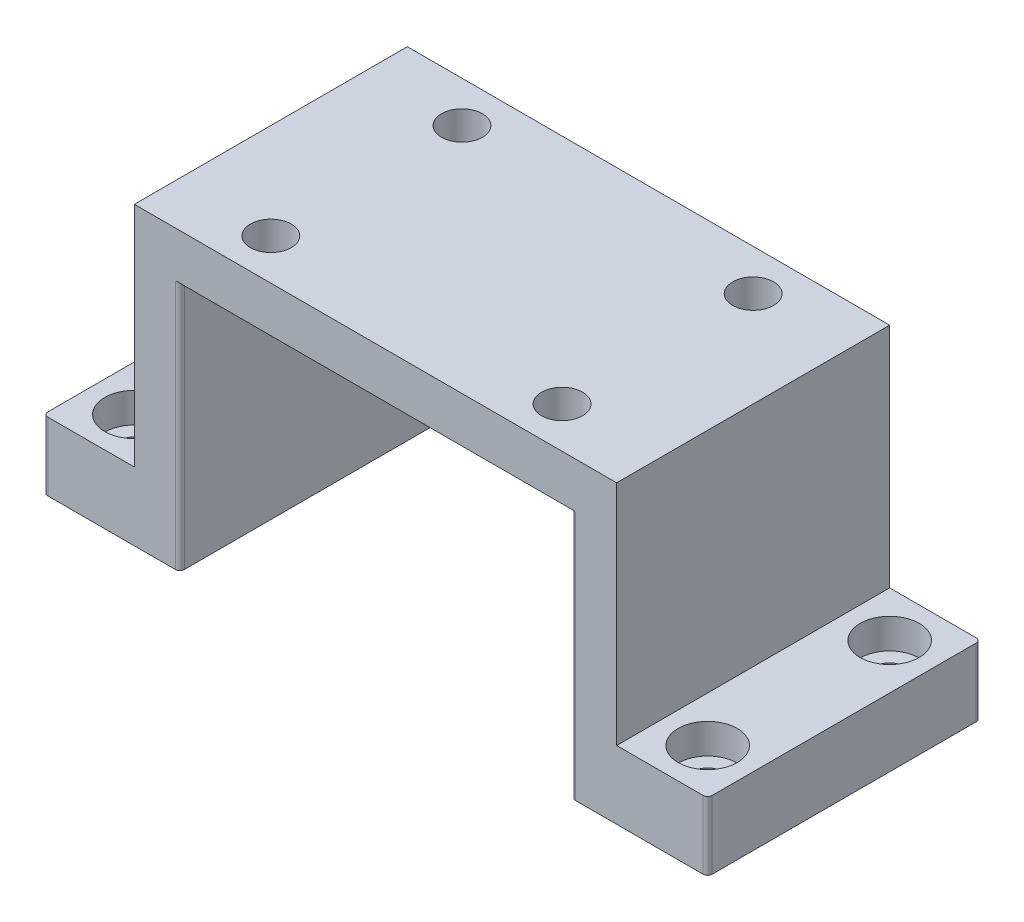
ISO-10303-21;
HEADER;
FILE_DESCRIPTION(('STEP AP214'),'2;1');
FILE_NAME('part.step','',(''),(''),'','','');
FILE_SCHEMA(('AUTOMOTIVE_DESIGN { 1 0 10303 214 1 1 1 1 }'));
ENDSEC;
DATA;
#1=APPLICATION_CONTEXT('core data for automotive mechanical design processes');
#2=APPLICATION_PROTOCOL_DEFINITION('international standard','automotive_design',2000,#1);
#3=PRODUCT_CONTEXT('',#1,'mechanical');
#4=PRODUCT('Part','Part','',(#3));
#5=PRODUCT_RELATED_PRODUCT_CATEGORY('part','',(#4));
#6=PRODUCT_DEFINITION_FORMATION('','',#4);
#7=PRODUCT_DEFINITION_CONTEXT('part definition',#1,'design');
#8=PRODUCT_DEFINITION('design','',#6,#7);
#9=PRODUCT_DEFINITION_SHAPE('','',#8);
#10=(LENGTH_UNIT() NAMED_UNIT(*) SI_UNIT(.MILLI.,.METRE.));
#11=(NAMED_UNIT(*) PLANE_ANGLE_UNIT() SI_UNIT($,.RADIAN.));
#12=(NAMED_UNIT(*) SI_UNIT($,.STERADIAN.) SOLID_ANGLE_UNIT());
#13=UNCERTAINTY_MEASURE_WITH_UNIT(LENGTH_MEASURE(1.E-05),#10,'distance_accuracy_value','');
#14=(GEOMETRIC_REPRESENTATION_CONTEXT(3) GLOBAL_UNCERTAINTY_ASSIGNED_CONTEXT((#13)) GLOBAL_UNIT_ASSIGNED_CONTEXT((#10,
#11,#12)) REPRESENTATION_CONTEXT('',''));
#15=CARTESIAN_POINT('',(0.,0.,0.));
#16=DIRECTION('',(0.,0.,1.));
#17=DIRECTION('',(1.,0.,0.));
#18=AXIS2_PLACEMENT_3D('',#15,#16,#17);
#19=CARTESIAN_POINT('',(-53.,10.,30.));
#20=DIRECTION('',(1.,0.,0.));
#21=DIRECTION('',(0.,0.,-1.));
#22=AXIS2_PLACEMENT_3D('',#19,#20,#21);
#23=PLANE('',#22);
#24=DIRECTION('',(0.,0.,-1.));
#25=VECTOR('',#24,1.);
#26=CARTESIAN_POINT('',(-53.,-40.,-30.));
#27=LINE('',#26,#25);
#28=CARTESIAN_POINT('',(-53.,-40.,30.));
#29=VERTEX_POINT('',#28);
#30=CARTESIAN_POINT('',(-53.,-40.,-30.));
#31=VERTEX_POINT('',#30);
#32=EDGE_CURVE('E198',#29,#31,#27,.T.);
#33=ORIENTED_EDGE('',*,*,#32,.F.);
#34=DIRECTION('',(0.,-1.,0.));
#35=VECTOR('',#34,1.);
#36=CARTESIAN_POINT('',(-53.,10.,30.));
#37=LINE('',#36,#35);
#38=CARTESIAN_POINT('',(-53.,10.,30.));
#39=VERTEX_POINT('',#38);
#40=EDGE_CURVE('E203',#39,#29,#37,.T.);
#41=ORIENTED_EDGE('',*,*,#40,.F.);
#42=DIRECTION('',(0.,0.,1.));
#43=VECTOR('',#42,1.);
#44=CARTESIAN_POINT('',(-53.,10.,30.));
#45=LINE('',#44,#43);
#46=CARTESIAN_POINT('',(-53.,10.,-30.));
#47=VERTEX_POINT('',#46);
#48=EDGE_CURVE('E200',#47,#39,#45,.T.);
#49=ORIENTED_EDGE('',*,*,#48,.F.);
#50=DIRECTION('',(0.,-1.,0.));
#51=VECTOR('',#50,1.);
#52=CARTESIAN_POINT('',(-53.,10.,-30.));
#53=LINE('',#52,#51);
#54=EDGE_CURVE('E185',#47,#31,#53,.T.);
#55=ORIENTED_EDGE('',*,*,#54,.T.);
#56=EDGE_LOOP('',(#33,#41,#49,#55));
#57=FACE_BOUND('',#56,.T.);
#58=ADVANCED_FACE('F42',(#57),#23,.F.);
#59=CARTESIAN_POINT('',(53.,10.,30.));
#60=DIRECTION('',(-1.,0.,0.));
#61=DIRECTION('',(0.,0.,1.));
#62=AXIS2_PLACEMENT_3D('',#59,#60,#61);
#63=PLANE('',#62);
#64=DIRECTION('',(0.,0.,1.));
#65=VECTOR('',#64,1.);
#66=CARTESIAN_POINT('',(53.,-40.,30.));
#67=LINE('',#66,#65);
#68=CARTESIAN_POINT('',(53.,-40.,-30.));
#69=VERTEX_POINT('',#68);
#70=CARTESIAN_POINT('',(53.,-40.,30.));
#71=VERTEX_POINT('',#70);
#72=EDGE_CURVE('E223',#69,#71,#67,.T.);
#73=ORIENTED_EDGE('',*,*,#72,.F.);
#74=DIRECTION('',(0.,-1.,0.));
#75=VECTOR('',#74,1.);
#76=CARTESIAN_POINT('',(53.,10.,-30.));
#77=LINE('',#76,#75);
#78=CARTESIAN_POINT('',(53.,10.,-30.));
#79=VERTEX_POINT('',#78);
#80=EDGE_CURVE('E202',#79,#69,#77,.T.);
#81=ORIENTED_EDGE('',*,*,#80,.F.);
#82=DIRECTION('',(0.,0.,-1.));
#83=VECTOR('',#82,1.);
#84=CARTESIAN_POINT('',(53.,10.,30.));
#85=LINE('',#84,#83);
#86=CARTESIAN_POINT('',(53.,10.,30.));
#87=VERTEX_POINT('',#86);
#88=EDGE_CURVE('E274',#87,#79,#85,.T.);
#89=ORIENTED_EDGE('',*,*,#88,.F.);
#90=DIRECTION('',(0.,-1.,0.));
#91=VECTOR('',#90,1.);
#92=CARTESIAN_POINT('',(53.,10.,30.));
#93=LINE('',#92,#91);
#94=EDGE_CURVE('E287',#87,#71,#93,.T.);
#95=ORIENTED_EDGE('',*,*,#94,.T.);
#96=EDGE_LOOP('',(#73,#81,#89,#95));
#97=FACE_BOUND('',#96,.T.);
#98=ADVANCED_FACE('F430',(#97),#63,.F.);
#99=CARTESIAN_POINT('',(0.,0.,0.));
#100=DIRECTION('',(0.,-1.,0.));
#101=DIRECTION('',(0.,0.,-1.));
#102=AXIS2_PLACEMENT_3D('',#99,#100,#101);
#103=PLANE('',#102);
#104=CARTESIAN_POINT('',(-32.,0.,21.));
#105=DIRECTION('',(0.,-1.,0.));
#106=DIRECTION('',(0.,0.,-1.));
#107=AXIS2_PLACEMENT_3D('',#104,#105,#106);
#108=CIRCLE('',#107,4.5);
#109=CARTESIAN_POINT('',(-32.,0.,16.5));
#110=VERTEX_POINT('',#109);
#111=EDGE_CURVE('E209',#110,#110,#108,.T.);
#112=ORIENTED_EDGE('',*,*,#111,.F.);
#113=EDGE_LOOP('',(#112));
#114=FACE_BOUND('',#113,.T.);
#115=CARTESIAN_POINT('',(32.,0.,21.));
#116=DIRECTION('',(0.,-1.,0.));
#117=DIRECTION('',(0.,0.,-1.));
#118=AXIS2_PLACEMENT_3D('',#115,#116,#117);
#119=CIRCLE('',#118,4.5);
#120=CARTESIAN_POINT('',(32.,0.,16.5));
#121=VERTEX_POINT('',#120);
#122=EDGE_CURVE('E217',#121,#121,#119,.T.);
#123=ORIENTED_EDGE('',*,*,#122,.F.);
#124=EDGE_LOOP('',(#123));
#125=FACE_BOUND('',#124,.T.);
#126=CARTESIAN_POINT('',(32.,0.,-21.));
#127=DIRECTION('',(0.,-1.,0.));
#128=DIRECTION('',(0.,0.,-1.));
#129=AXIS2_PLACEMENT_3D('',#126,#127,#128);
#130=CIRCLE('',#129,4.5);
#131=CARTESIAN_POINT('',(32.,0.,-25.5));
#132=VERTEX_POINT('',#131);
#133=EDGE_CURVE('E669',#132,#132,#130,.T.);
#134=ORIENTED_EDGE('',*,*,#133,.F.);
#135=EDGE_LOOP('',(#134));
#136=FACE_BOUND('',#135,.T.);
#137=CARTESIAN_POINT('',(-32.,0.,-21.));
#138=DIRECTION('',(0.,-1.,0.));
#139=DIRECTION('',(0.,0.,-1.));
#140=AXIS2_PLACEMENT_3D('',#137,#138,#139);
#141=CIRCLE('',#140,4.5);
#142=CARTESIAN_POINT('',(-32.,0.,-25.5));
#143=VERTEX_POINT('',#142);
#144=EDGE_CURVE('E665',#143,#143,#141,.T.);
#145=ORIENTED_EDGE('',*,*,#144,.F.);
#146=EDGE_LOOP('',(#145));
#147=FACE_BOUND('',#146,.T.);
#148=DIRECTION('',(-1.,0.,0.));
#149=VECTOR('',#148,1.);
#150=CARTESIAN_POINT('',(-53.,0.,-30.));
#151=LINE('',#150,#149);
#152=CARTESIAN_POINT('',(44.,0.,-30.));
#153=VERTEX_POINT('',#152);
#154=CARTESIAN_POINT('',(-44.,0.,-30.));
#155=VERTEX_POINT('',#154);
#156=EDGE_CURVE('E270',#153,#155,#151,.T.);
#157=ORIENTED_EDGE('',*,*,#156,.F.);
#158=CARTESIAN_POINT('',(44.,0.,-29.));
#159=DIRECTION('',(0.,-1.,0.));
#160=DIRECTION('',(0.,0.,-1.));
#161=AXIS2_PLACEMENT_3D('',#158,#159,#160);
#162=CIRCLE('',#161,1.);
#163=CARTESIAN_POINT('',(43.,0.,-29.));
#164=VERTEX_POINT('',#163);
#165=EDGE_CURVE('E388',#153,#164,#162,.F.);
#166=ORIENTED_EDGE('',*,*,#165,.T.);
#167=DIRECTION('',(0.,0.,-1.));
#168=VECTOR('',#167,1.);
#169=CARTESIAN_POINT('',(43.,0.,30.));
#170=LINE('',#169,#168);
#171=CARTESIAN_POINT('',(43.,0.,29.));
#172=VERTEX_POINT('',#171);
#173=EDGE_CURVE('E241',#172,#164,#170,.T.);
#174=ORIENTED_EDGE('',*,*,#173,.F.);
#175=CARTESIAN_POINT('',(44.,0.,29.));
#176=DIRECTION('',(0.,-1.,0.));
#177=DIRECTION('',(0.,0.,-1.));
#178=AXIS2_PLACEMENT_3D('',#175,#176,#177);
#179=CIRCLE('',#178,1.);
#180=CARTESIAN_POINT('',(44.,0.,30.));
#181=VERTEX_POINT('',#180);
#182=EDGE_CURVE('E51',#172,#181,#179,.F.);
#183=ORIENTED_EDGE('',*,*,#182,.T.);
#184=DIRECTION('',(1.,0.,0.));
#185=VECTOR('',#184,1.);
#186=CARTESIAN_POINT('',(-53.,0.,30.));
#187=LINE('',#186,#185);
#188=CARTESIAN_POINT('',(-44.,0.,30.));
#189=VERTEX_POINT('',#188);
#190=EDGE_CURVE('E279',#189,#181,#187,.T.);
#191=ORIENTED_EDGE('',*,*,#190,.F.);
#192=CARTESIAN_POINT('',(-44.,0.,29.));
#193=DIRECTION('',(0.,-1.,0.));
#194=DIRECTION('',(0.,0.,-1.));
#195=AXIS2_PLACEMENT_3D('',#192,#193,#194);
#196=CIRCLE('',#195,1.);
#197=CARTESIAN_POINT('',(-43.,0.,29.));
#198=VERTEX_POINT('',#197);
#199=EDGE_CURVE('E11',#189,#198,#196,.F.);
#200=ORIENTED_EDGE('',*,*,#199,.T.);
#201=DIRECTION('',(0.,0.,1.));
#202=VECTOR('',#201,1.);
#203=CARTESIAN_POINT('',(-43.,0.,30.));
#204=LINE('',#203,#202);
#205=CARTESIAN_POINT('',(-43.,0.,-29.));
#206=VERTEX_POINT('',#205);
#207=EDGE_CURVE('E254',#206,#198,#204,.T.);
#208=ORIENTED_EDGE('',*,*,#207,.F.);
#209=CARTESIAN_POINT('',(-44.,0.,-29.));
#210=DIRECTION('',(0.,-1.,0.));
#211=DIRECTION('',(0.,0.,-1.));
#212=AXIS2_PLACEMENT_3D('',#209,#210,#211);
#213=CIRCLE('',#212,1.);
#214=EDGE_CURVE('E391',#206,#155,#213,.F.);
#215=ORIENTED_EDGE('',*,*,#214,.T.);
#216=EDGE_LOOP('',(#157,#166,#174,#183,#191,#200,#208,#215));
#217=FACE_BOUND('',#216,.T.);
#218=ADVANCED_FACE('F400',(#114,#125,#136,#147,#217),#103,.T.);
#219=CARTESIAN_POINT('',(-53.,10.,-30.));
#220=DIRECTION('',(0.,0.,1.));
#221=DIRECTION('',(1.,0.,0.));
#222=AXIS2_PLACEMENT_3D('',#219,#220,#221);
#223=PLANE('',#222);
#224=DIRECTION('',(-1.,0.,0.));
#225=VECTOR('',#224,1.);
#226=CARTESIAN_POINT('',(73.,-40.,-30.));
#227=LINE('',#226,#225);
#228=CARTESIAN_POINT('',(72.,-40.,-30.));
#229=VERTEX_POINT('',#228);
#230=EDGE_CURVE('E238',#229,#69,#227,.T.);
#231=ORIENTED_EDGE('',*,*,#230,.F.);
#232=DIRECTION('',(0.,1.,0.));
#233=VECTOR('',#232,1.);
#234=CARTESIAN_POINT('',(72.,10.,-30.));
#235=LINE('',#234,#233);
#236=CARTESIAN_POINT('',(72.,-55.,-30.));
#237=VERTEX_POINT('',#236);
#238=EDGE_CURVE('E323',#229,#237,#235,.F.);
#239=ORIENTED_EDGE('',*,*,#238,.T.);
#240=DIRECTION('',(1.,0.,0.));
#241=VECTOR('',#240,1.);
#242=CARTESIAN_POINT('',(53.,-55.,-30.));
#243=LINE('',#242,#241);
#244=CARTESIAN_POINT('',(44.,-55.,-30.));
#245=VERTEX_POINT('',#244);
#246=EDGE_CURVE('E250',#245,#237,#243,.T.);
#247=ORIENTED_EDGE('',*,*,#246,.F.);
#248=DIRECTION('',(0.,1.,0.));
#249=VECTOR('',#248,1.);
#250=CARTESIAN_POINT('',(44.,10.,-30.));
#251=LINE('',#250,#249);
#252=EDGE_CURVE('E319',#245,#153,#251,.T.);
#253=ORIENTED_EDGE('',*,*,#252,.T.);
#254=ORIENTED_EDGE('',*,*,#156,.T.);
#255=DIRECTION('',(0.,1.,0.));
#256=VECTOR('',#255,1.);
#257=CARTESIAN_POINT('',(-44.,10.,-30.));
#258=LINE('',#257,#256);
#259=CARTESIAN_POINT('',(-44.,-55.,-30.));
#260=VERTEX_POINT('',#259);
#261=EDGE_CURVE('E316',#155,#260,#258,.F.);
#262=ORIENTED_EDGE('',*,*,#261,.T.);
#263=DIRECTION('',(1.,0.,0.));
#264=VECTOR('',#263,1.);
#265=CARTESIAN_POINT('',(-53.,-55.,-30.));
#266=LINE('',#265,#264);
#267=CARTESIAN_POINT('',(-72.,-55.,-30.));
#268=VERTEX_POINT('',#267);
#269=EDGE_CURVE('E258',#268,#260,#266,.T.);
#270=ORIENTED_EDGE('',*,*,#269,.F.);
#271=DIRECTION('',(0.,-1.,0.));
#272=VECTOR('',#271,1.);
#273=CARTESIAN_POINT('',(-72.,10.,-30.));
#274=LINE('',#273,#272);
#275=CARTESIAN_POINT('',(-72.,-40.,-30.));
#276=VERTEX_POINT('',#275);
#277=EDGE_CURVE('E189',#268,#276,#274,.F.);
#278=ORIENTED_EDGE('',*,*,#277,.T.);
#279=DIRECTION('',(1.,0.,0.));
#280=VECTOR('',#279,1.);
#281=CARTESIAN_POINT('',(-73.,-40.,-30.));
#282=LINE('',#281,#280);
#283=EDGE_CURVE('E181',#276,#31,#282,.T.);
#284=ORIENTED_EDGE('',*,*,#283,.T.);
#285=ORIENTED_EDGE('',*,*,#54,.F.);
#286=DIRECTION('',(-1.,0.,0.));
#287=VECTOR('',#286,1.);
#288=CARTESIAN_POINT('',(-53.,10.,-30.));
#289=LINE('',#288,#287);
#290=EDGE_CURVE('E278',#79,#47,#289,.T.);
#291=ORIENTED_EDGE('',*,*,#290,.F.);
#292=ORIENTED_EDGE('',*,*,#80,.T.);
#293=EDGE_LOOP('',(#231,#239,#247,#253,#254,#262,#270,#278,#284,#285,#291,#292));
#294=FACE_BOUND('',#293,.T.);
#295=ADVANCED_FACE('F184',(#294),#223,.F.);
#296=CARTESIAN_POINT('',(-53.,10.,30.));
#297=DIRECTION('',(0.,0.,-1.));
#298=DIRECTION('',(-1.,0.,0.));
#299=AXIS2_PLACEMENT_3D('',#296,#297,#298);
#300=PLANE('',#299);
#301=DIRECTION('',(-1.,0.,0.));
#302=VECTOR('',#301,1.);
#303=CARTESIAN_POINT('',(53.,-55.,30.));
#304=LINE('',#303,#302);
#305=CARTESIAN_POINT('',(72.,-55.,30.));
#306=VERTEX_POINT('',#305);
#307=CARTESIAN_POINT('',(44.,-55.,30.));
#308=VERTEX_POINT('',#307);
#309=EDGE_CURVE('E242',#306,#308,#304,.T.);
#310=ORIENTED_EDGE('',*,*,#309,.F.);
#311=DIRECTION('',(0.,-1.,0.));
#312=VECTOR('',#311,1.);
#313=CARTESIAN_POINT('',(72.,10.,30.));
#314=LINE('',#313,#312);
#315=CARTESIAN_POINT('',(72.,-40.,30.));
#316=VERTEX_POINT('',#315);
#317=EDGE_CURVE('E374',#306,#316,#314,.F.);
#318=ORIENTED_EDGE('',*,*,#317,.T.);
#319=DIRECTION('',(-1.,0.,0.));
#320=VECTOR('',#319,1.);
#321=CARTESIAN_POINT('',(73.,-40.,30.));
#322=LINE('',#321,#320);
#323=EDGE_CURVE('E232',#316,#71,#322,.T.);
#324=ORIENTED_EDGE('',*,*,#323,.T.);
#325=ORIENTED_EDGE('',*,*,#94,.F.);
#326=DIRECTION('',(1.,0.,0.));
#327=VECTOR('',#326,1.);
#328=CARTESIAN_POINT('',(-53.,10.,30.));
#329=LINE('',#328,#327);
#330=EDGE_CURVE('E284',#39,#87,#329,.T.);
#331=ORIENTED_EDGE('',*,*,#330,.F.);
#332=ORIENTED_EDGE('',*,*,#40,.T.);
#333=DIRECTION('',(1.,0.,0.));
#334=VECTOR('',#333,1.);
#335=CARTESIAN_POINT('',(-73.,-40.,30.));
#336=LINE('',#335,#334);
#337=CARTESIAN_POINT('',(-72.,-40.,30.));
#338=VERTEX_POINT('',#337);
#339=EDGE_CURVE('E192',#338,#29,#336,.T.);
#340=ORIENTED_EDGE('',*,*,#339,.F.);
#341=DIRECTION('',(0.,1.,0.));
#342=VECTOR('',#341,1.);
#343=CARTESIAN_POINT('',(-72.,10.,30.));
#344=LINE('',#343,#342);
#345=CARTESIAN_POINT('',(-72.,-55.,30.));
#346=VERTEX_POINT('',#345);
#347=EDGE_CURVE('E364',#338,#346,#344,.F.);
#348=ORIENTED_EDGE('',*,*,#347,.T.);
#349=DIRECTION('',(-1.,0.,0.));
#350=VECTOR('',#349,1.);
#351=CARTESIAN_POINT('',(-53.,-55.,30.));
#352=LINE('',#351,#350);
#353=CARTESIAN_POINT('',(-44.,-55.,30.));
#354=VERTEX_POINT('',#353);
#355=EDGE_CURVE('E266',#354,#346,#352,.T.);
#356=ORIENTED_EDGE('',*,*,#355,.F.);
#357=DIRECTION('',(0.,1.,0.));
#358=VECTOR('',#357,1.);
#359=CARTESIAN_POINT('',(-44.,10.,30.));
#360=LINE('',#359,#358);
#361=EDGE_CURVE('E367',#354,#189,#360,.T.);
#362=ORIENTED_EDGE('',*,*,#361,.T.);
#363=ORIENTED_EDGE('',*,*,#190,.T.);
#364=DIRECTION('',(0.,1.,0.));
#365=VECTOR('',#364,1.);
#366=CARTESIAN_POINT('',(44.,10.,30.));
#367=LINE('',#366,#365);
#368=EDGE_CURVE('E371',#181,#308,#367,.F.);
#369=ORIENTED_EDGE('',*,*,#368,.T.);
#370=EDGE_LOOP('',(#310,#318,#324,#325,#331,#332,#340,#348,#356,#362,#363,#369));
#371=FACE_BOUND('',#370,.T.);
#372=ADVANCED_FACE('F408',(#371),#300,.F.);
#373=CARTESIAN_POINT('',(0.,10.,0.));
#374=DIRECTION('',(0.,-1.,0.));
#375=DIRECTION('',(0.,0.,-1.));
#376=AXIS2_PLACEMENT_3D('',#373,#374,#375);
#377=PLANE('',#376);
#378=CARTESIAN_POINT('',(-32.,10.,21.));
#379=DIRECTION('',(0.,1.,0.));
#380=DIRECTION('',(0.,0.,-1.));
#381=AXIS2_PLACEMENT_3D('',#378,#379,#380);
#382=CIRCLE('',#381,4.5);
#383=CARTESIAN_POINT('',(-32.,10.,16.5));
#384=VERTEX_POINT('',#383);
#385=EDGE_CURVE('E646',#384,#384,#382,.T.);
#386=ORIENTED_EDGE('',*,*,#385,.F.);
#387=EDGE_LOOP('',(#386));
#388=FACE_BOUND('',#387,.T.);
#389=CARTESIAN_POINT('',(32.,10.,21.));
#390=DIRECTION('',(0.,1.,0.));
#391=DIRECTION('',(0.,0.,1.));
#392=AXIS2_PLACEMENT_3D('',#389,#390,#391);
#393=CIRCLE('',#392,4.5);
#394=CARTESIAN_POINT('',(32.,10.,25.5));
#395=VERTEX_POINT('',#394);
#396=EDGE_CURVE('E655',#395,#395,#393,.T.);
#397=ORIENTED_EDGE('',*,*,#396,.F.);
#398=EDGE_LOOP('',(#397));
#399=FACE_BOUND('',#398,.T.);
#400=CARTESIAN_POINT('',(32.,10.,-21.));
#401=DIRECTION('',(0.,1.,0.));
#402=DIRECTION('',(0.,0.,-1.));
#403=AXIS2_PLACEMENT_3D('',#400,#401,#402);
#404=CIRCLE('',#403,4.5);
#405=CARTESIAN_POINT('',(32.,10.,-25.5));
#406=VERTEX_POINT('',#405);
#407=EDGE_CURVE('E650',#406,#406,#404,.T.);
#408=ORIENTED_EDGE('',*,*,#407,.F.);
#409=EDGE_LOOP('',(#408));
#410=FACE_BOUND('',#409,.T.);
#411=CARTESIAN_POINT('',(-32.,10.,-21.));
#412=DIRECTION('',(0.,1.,0.));
#413=DIRECTION('',(0.,0.,1.));
#414=AXIS2_PLACEMENT_3D('',#411,#412,#413);
#415=CIRCLE('',#414,4.5);
#416=CARTESIAN_POINT('',(-32.,10.,-16.5));
#417=VERTEX_POINT('',#416);
#418=EDGE_CURVE('E654',#417,#417,#415,.T.);
#419=ORIENTED_EDGE('',*,*,#418,.F.);
#420=EDGE_LOOP('',(#419));
#421=FACE_BOUND('',#420,.T.);
#422=ORIENTED_EDGE('',*,*,#88,.T.);
#423=ORIENTED_EDGE('',*,*,#290,.T.);
#424=ORIENTED_EDGE('',*,*,#48,.T.);
#425=ORIENTED_EDGE('',*,*,#330,.T.);
#426=EDGE_LOOP('',(#422,#423,#424,#425));
#427=FACE_BOUND('',#426,.T.);
#428=ADVANCED_FACE('F433',(#388,#399,#410,#421,#427),#377,.F.);
#429=CARTESIAN_POINT('',(-43.,-55.,30.));
#430=DIRECTION('',(-1.,0.,0.));
#431=DIRECTION('',(0.,0.,1.));
#432=AXIS2_PLACEMENT_3D('',#429,#430,#431);
#433=PLANE('',#432);
#434=DIRECTION('',(0.,0.,1.));
#435=VECTOR('',#434,1.);
#436=CARTESIAN_POINT('',(-43.,-55.,30.));
#437=LINE('',#436,#435);
#438=CARTESIAN_POINT('',(-43.,-55.,-29.));
#439=VERTEX_POINT('',#438);
#440=CARTESIAN_POINT('',(-43.,-55.,29.));
#441=VERTEX_POINT('',#440);
#442=EDGE_CURVE('E262',#439,#441,#437,.T.);
#443=ORIENTED_EDGE('',*,*,#442,.F.);
#444=DIRECTION('',(0.,1.,0.));
#445=VECTOR('',#444,1.);
#446=CARTESIAN_POINT('',(-43.,-55.,-29.));
#447=LINE('',#446,#445);
#448=EDGE_CURVE('E348',#439,#206,#447,.T.);
#449=ORIENTED_EDGE('',*,*,#448,.T.);
#450=ORIENTED_EDGE('',*,*,#207,.T.);
#451=DIRECTION('',(0.,1.,0.));
#452=VECTOR('',#451,1.);
#453=CARTESIAN_POINT('',(-43.,-55.,29.));
#454=LINE('',#453,#452);
#455=EDGE_CURVE('E345',#198,#441,#454,.F.);
#456=ORIENTED_EDGE('',*,*,#455,.T.);
#457=EDGE_LOOP('',(#443,#449,#450,#456));
#458=FACE_BOUND('',#457,.T.);
#459=ADVANCED_FACE('F452',(#458),#433,.F.);
#460=CARTESIAN_POINT('',(0.,-55.,0.));
#461=DIRECTION('',(0.,-1.,0.));
#462=DIRECTION('',(0.,0.,-1.));
#463=AXIS2_PLACEMENT_3D('',#460,#461,#462);
#464=PLANE('',#463);
#465=CARTESIAN_POINT('',(-63.,-55.,20.));
#466=DIRECTION('',(0.,1.,0.));
#467=DIRECTION('',(0.,0.,1.));
#468=AXIS2_PLACEMENT_3D('',#465,#466,#467);
#469=CIRCLE('',#468,3.3);
#470=CARTESIAN_POINT('',(-63.,-55.,23.3));
#471=VERTEX_POINT('',#470);
#472=EDGE_CURVE('E617',#471,#471,#469,.T.);
#473=ORIENTED_EDGE('',*,*,#472,.T.);
#474=EDGE_LOOP('',(#473));
#475=FACE_BOUND('',#474,.T.);
#476=CARTESIAN_POINT('',(-63.,-55.,-20.));
#477=DIRECTION('',(0.,1.,0.));
#478=DIRECTION('',(0.,0.,1.));
#479=AXIS2_PLACEMENT_3D('',#476,#477,#478);
#480=CIRCLE('',#479,3.3);
#481=CARTESIAN_POINT('',(-63.,-55.,-16.7));
#482=VERTEX_POINT('',#481);
#483=EDGE_CURVE('E608',#482,#482,#480,.T.);
#484=ORIENTED_EDGE('',*,*,#483,.T.);
#485=EDGE_LOOP('',(#484));
#486=FACE_BOUND('',#485,.T.);
#487=ORIENTED_EDGE('',*,*,#269,.T.);
#488=CARTESIAN_POINT('',(-44.,-55.,-29.));
#489=DIRECTION('',(0.,-1.,0.));
#490=DIRECTION('',(0.,0.,-1.));
#491=AXIS2_PLACEMENT_3D('',#488,#489,#490);
#492=CIRCLE('',#491,1.);
#493=EDGE_CURVE('E361',#260,#439,#492,.T.);
#494=ORIENTED_EDGE('',*,*,#493,.T.);
#495=ORIENTED_EDGE('',*,*,#442,.T.);
#496=CARTESIAN_POINT('',(-44.,-55.,29.));
#497=DIRECTION('',(0.,-1.,0.));
#498=DIRECTION('',(0.,0.,-1.));
#499=AXIS2_PLACEMENT_3D('',#496,#497,#498);
#500=CIRCLE('',#499,1.);
#501=EDGE_CURVE('E355',#441,#354,#500,.T.);
#502=ORIENTED_EDGE('',*,*,#501,.T.);
#503=ORIENTED_EDGE('',*,*,#355,.T.);
#504=CARTESIAN_POINT('',(-72.,-55.,29.));
#505=DIRECTION('',(0.,-1.,0.));
#506=DIRECTION('',(0.,0.,-1.));
#507=AXIS2_PLACEMENT_3D('',#504,#505,#506);
#508=CIRCLE('',#507,1.);
#509=CARTESIAN_POINT('',(-73.,-55.,29.));
#510=VERTEX_POINT('',#509);
#511=EDGE_CURVE('E352',#346,#510,#508,.T.);
#512=ORIENTED_EDGE('',*,*,#511,.T.);
#513=DIRECTION('',(0.,0.,1.));
#514=VECTOR('',#513,1.);
#515=CARTESIAN_POINT('',(-73.,-55.,-30.));
#516=LINE('',#515,#514);
#517=CARTESIAN_POINT('',(-73.,-55.,-29.));
#518=VERTEX_POINT('',#517);
#519=EDGE_CURVE('E208',#518,#510,#516,.T.);
#520=ORIENTED_EDGE('',*,*,#519,.F.);
#521=CARTESIAN_POINT('',(-72.,-55.,-29.));
#522=DIRECTION('',(0.,-1.,0.));
#523=DIRECTION('',(0.,0.,-1.));
#524=AXIS2_PLACEMENT_3D('',#521,#522,#523);
#525=CIRCLE('',#524,1.);
#526=EDGE_CURVE('E358',#518,#268,#525,.T.);
#527=ORIENTED_EDGE('',*,*,#526,.T.);
#528=EDGE_LOOP('',(#487,#494,#495,#502,#503,#512,#520,#527));
#529=FACE_BOUND('',#528,.T.);
#530=ADVANCED_FACE('F438',(#475,#486,#529),#464,.T.);
#531=CARTESIAN_POINT('',(43.,-55.,30.));
#532=DIRECTION('',(1.,0.,0.));
#533=DIRECTION('',(0.,0.,-1.));
#534=AXIS2_PLACEMENT_3D('',#531,#532,#533);
#535=PLANE('',#534);
#536=ORIENTED_EDGE('',*,*,#173,.T.);
#537=DIRECTION('',(0.,1.,0.));
#538=VECTOR('',#537,1.);
#539=CARTESIAN_POINT('',(43.,-55.,-29.));
#540=LINE('',#539,#538);
#541=CARTESIAN_POINT('',(43.,-55.,-29.));
#542=VERTEX_POINT('',#541);
#543=EDGE_CURVE('E342',#164,#542,#540,.F.);
#544=ORIENTED_EDGE('',*,*,#543,.T.);
#545=DIRECTION('',(0.,0.,-1.));
#546=VECTOR('',#545,1.);
#547=CARTESIAN_POINT('',(43.,-55.,30.));
#548=LINE('',#547,#546);
#549=CARTESIAN_POINT('',(43.,-55.,29.));
#550=VERTEX_POINT('',#549);
#551=EDGE_CURVE('E246',#550,#542,#548,.T.);
#552=ORIENTED_EDGE('',*,*,#551,.F.);
#553=DIRECTION('',(0.,1.,0.));
#554=VECTOR('',#553,1.);
#555=CARTESIAN_POINT('',(43.,-55.,29.));
#556=LINE('',#555,#554);
#557=EDGE_CURVE('E338',#550,#172,#556,.T.);
#558=ORIENTED_EDGE('',*,*,#557,.T.);
#559=EDGE_LOOP('',(#536,#544,#552,#558));
#560=FACE_BOUND('',#559,.T.);
#561=ADVANCED_FACE('F507',(#560),#535,.F.);
#562=CARTESIAN_POINT('',(0.,-55.,0.));
#563=DIRECTION('',(0.,1.,0.));
#564=DIRECTION('',(0.,0.,1.));
#565=AXIS2_PLACEMENT_3D('',#562,#563,#564);
#566=PLANE('',#565);
#567=CARTESIAN_POINT('',(63.,-55.,-20.));
#568=DIRECTION('',(0.,1.,0.));
#569=DIRECTION('',(0.,0.,1.));
#570=AXIS2_PLACEMENT_3D('',#567,#568,#569);
#571=CIRCLE('',#570,3.29999999999999);
#572=CARTESIAN_POINT('',(63.,-55.,-16.7));
#573=VERTEX_POINT('',#572);
#574=EDGE_CURVE('E593',#573,#573,#571,.T.);
#575=ORIENTED_EDGE('',*,*,#574,.T.);
#576=EDGE_LOOP('',(#575));
#577=FACE_BOUND('',#576,.T.);
#578=CARTESIAN_POINT('',(63.,-55.,20.));
#579=DIRECTION('',(0.,1.,0.));
#580=DIRECTION('',(0.,0.,1.));
#581=AXIS2_PLACEMENT_3D('',#578,#579,#580);
#582=CIRCLE('',#581,3.29999999999999);
#583=CARTESIAN_POINT('',(63.,-55.,23.3));
#584=VERTEX_POINT('',#583);
#585=EDGE_CURVE('E588',#584,#584,#582,.T.);
#586=ORIENTED_EDGE('',*,*,#585,.T.);
#587=EDGE_LOOP('',(#586));
#588=FACE_BOUND('',#587,.T.);
#589=ORIENTED_EDGE('',*,*,#246,.T.);
#590=CARTESIAN_POINT('',(72.,-55.,-29.));
#591=DIRECTION('',(0.,1.,0.));
#592=DIRECTION('',(0.,0.,1.));
#593=AXIS2_PLACEMENT_3D('',#590,#591,#592);
#594=CIRCLE('',#593,1.);
#595=CARTESIAN_POINT('',(73.,-55.,-29.));
#596=VERTEX_POINT('',#595);
#597=EDGE_CURVE('E335',#237,#596,#594,.F.);
#598=ORIENTED_EDGE('',*,*,#597,.T.);
#599=DIRECTION('',(0.,0.,-1.));
#600=VECTOR('',#599,1.);
#601=CARTESIAN_POINT('',(73.,-55.,30.));
#602=LINE('',#601,#600);
#603=CARTESIAN_POINT('',(73.,-55.,29.));
#604=VERTEX_POINT('',#603);
#605=EDGE_CURVE('E224',#604,#596,#602,.T.);
#606=ORIENTED_EDGE('',*,*,#605,.F.);
#607=CARTESIAN_POINT('',(72.,-55.,29.));
#608=DIRECTION('',(0.,1.,0.));
#609=DIRECTION('',(0.,0.,1.));
#610=AXIS2_PLACEMENT_3D('',#607,#608,#609);
#611=CIRCLE('',#610,1.);
#612=EDGE_CURVE('E329',#604,#306,#611,.F.);
#613=ORIENTED_EDGE('',*,*,#612,.T.);
#614=ORIENTED_EDGE('',*,*,#309,.T.);
#615=CARTESIAN_POINT('',(44.,-55.,29.));
#616=DIRECTION('',(0.,1.,0.));
#617=DIRECTION('',(0.,0.,1.));
#618=AXIS2_PLACEMENT_3D('',#615,#616,#617);
#619=CIRCLE('',#618,1.);
#620=EDGE_CURVE('E326',#308,#550,#619,.F.);
#621=ORIENTED_EDGE('',*,*,#620,.T.);
#622=ORIENTED_EDGE('',*,*,#551,.T.);
#623=CARTESIAN_POINT('',(44.,-55.,-29.));
#624=DIRECTION('',(0.,1.,0.));
#625=DIRECTION('',(0.,0.,1.));
#626=AXIS2_PLACEMENT_3D('',#623,#624,#625);
#627=CIRCLE('',#626,1.);
#628=EDGE_CURVE('E332',#542,#245,#627,.F.);
#629=ORIENTED_EDGE('',*,*,#628,.T.);
#630=EDGE_LOOP('',(#589,#598,#606,#613,#614,#621,#622,#629));
#631=FACE_BOUND('',#630,.T.);
#632=ADVANCED_FACE('F411',(#577,#588,#631),#566,.F.);
#633=CARTESIAN_POINT('',(73.,-40.,30.));
#634=DIRECTION('',(0.,-1.,0.));
#635=DIRECTION('',(0.,0.,-1.));
#636=AXIS2_PLACEMENT_3D('',#633,#634,#635);
#637=PLANE('',#636);
#638=CARTESIAN_POINT('',(63.,-40.,20.));
#639=DIRECTION('',(0.,1.,0.));
#640=DIRECTION('',(0.,0.,1.));
#641=AXIS2_PLACEMENT_3D('',#638,#639,#640);
#642=CIRCLE('',#641,6.5);
#643=CARTESIAN_POINT('',(63.,-40.,26.5));
#644=VERTEX_POINT('',#643);
#645=EDGE_CURVE('E631',#644,#644,#642,.T.);
#646=ORIENTED_EDGE('',*,*,#645,.F.);
#647=EDGE_LOOP('',(#646));
#648=FACE_BOUND('',#647,.T.);
#649=CARTESIAN_POINT('',(63.,-40.,-20.));
#650=DIRECTION('',(0.,1.,0.));
#651=DIRECTION('',(0.,0.,1.));
#652=AXIS2_PLACEMENT_3D('',#649,#650,#651);
#653=CIRCLE('',#652,6.5);
#654=CARTESIAN_POINT('',(63.,-40.,-13.5));
#655=VERTEX_POINT('',#654);
#656=EDGE_CURVE('E630',#655,#655,#653,.T.);
#657=ORIENTED_EDGE('',*,*,#656,.F.);
#658=EDGE_LOOP('',(#657));
#659=FACE_BOUND('',#658,.T.);
#660=DIRECTION('',(0.,0.,1.));
#661=VECTOR('',#660,1.);
#662=CARTESIAN_POINT('',(73.,-40.,30.));
#663=LINE('',#662,#661);
#664=CARTESIAN_POINT('',(73.,-40.,-29.));
#665=VERTEX_POINT('',#664);
#666=CARTESIAN_POINT('',(73.,-40.,29.));
#667=VERTEX_POINT('',#666);
#668=EDGE_CURVE('E228',#665,#667,#663,.T.);
#669=ORIENTED_EDGE('',*,*,#668,.F.);
#670=CARTESIAN_POINT('',(72.,-40.,-29.));
#671=DIRECTION('',(0.,-1.,0.));
#672=DIRECTION('',(0.,0.,-1.));
#673=AXIS2_PLACEMENT_3D('',#670,#671,#672);
#674=CIRCLE('',#673,1.);
#675=EDGE_CURVE('E311',#665,#229,#674,.F.);
#676=ORIENTED_EDGE('',*,*,#675,.T.);
#677=ORIENTED_EDGE('',*,*,#230,.T.);
#678=ORIENTED_EDGE('',*,*,#72,.T.);
#679=ORIENTED_EDGE('',*,*,#323,.F.);
#680=CARTESIAN_POINT('',(72.,-40.,29.));
#681=DIRECTION('',(0.,-1.,0.));
#682=DIRECTION('',(0.,0.,-1.));
#683=AXIS2_PLACEMENT_3D('',#680,#681,#682);
#684=CIRCLE('',#683,1.);
#685=EDGE_CURVE('E308',#316,#667,#684,.F.);
#686=ORIENTED_EDGE('',*,*,#685,.T.);
#687=EDGE_LOOP('',(#669,#676,#677,#678,#679,#686));
#688=FACE_BOUND('',#687,.T.);
#689=ADVANCED_FACE('F423',(#648,#659,#688),#637,.F.);
#690=CARTESIAN_POINT('',(73.,0.,0.));
#691=DIRECTION('',(-1.,0.,0.));
#692=DIRECTION('',(0.,0.,1.));
#693=AXIS2_PLACEMENT_3D('',#690,#691,#692);
#694=PLANE('',#693);
#695=ORIENTED_EDGE('',*,*,#605,.T.);
#696=DIRECTION('',(0.,1.,0.));
#697=VECTOR('',#696,1.);
#698=CARTESIAN_POINT('',(73.,0.,-29.));
#699=LINE('',#698,#697);
#700=EDGE_CURVE('E304',#596,#665,#699,.T.);
#701=ORIENTED_EDGE('',*,*,#700,.T.);
#702=ORIENTED_EDGE('',*,*,#668,.T.);
#703=DIRECTION('',(0.,-1.,0.));
#704=VECTOR('',#703,1.);
#705=CARTESIAN_POINT('',(73.,0.,29.));
#706=LINE('',#705,#704);
#707=EDGE_CURVE('E300',#667,#604,#706,.T.);
#708=ORIENTED_EDGE('',*,*,#707,.T.);
#709=EDGE_LOOP('',(#695,#701,#702,#708));
#710=FACE_BOUND('',#709,.T.);
#711=ADVANCED_FACE('F419',(#710),#694,.F.);
#712=CARTESIAN_POINT('',(-73.,-40.,-30.));
#713=DIRECTION('',(0.,-1.,0.));
#714=DIRECTION('',(0.,0.,-1.));
#715=AXIS2_PLACEMENT_3D('',#712,#713,#714);
#716=PLANE('',#715);
#717=CARTESIAN_POINT('',(-63.,-40.,-20.));
#718=DIRECTION('',(0.,1.,0.));
#719=DIRECTION('',(0.,0.,1.));
#720=AXIS2_PLACEMENT_3D('',#717,#718,#719);
#721=CIRCLE('',#720,6.5);
#722=CARTESIAN_POINT('',(-63.,-40.,-13.5));
#723=VERTEX_POINT('',#722);
#724=EDGE_CURVE('E622',#723,#723,#721,.T.);
#725=ORIENTED_EDGE('',*,*,#724,.F.);
#726=EDGE_LOOP('',(#725));
#727=FACE_BOUND('',#726,.T.);
#728=CARTESIAN_POINT('',(-63.,-40.,20.));
#729=DIRECTION('',(0.,1.,0.));
#730=DIRECTION('',(0.,0.,1.));
#731=AXIS2_PLACEMENT_3D('',#728,#729,#730);
#732=CIRCLE('',#731,6.5);
#733=CARTESIAN_POINT('',(-63.,-40.,26.5));
#734=VERTEX_POINT('',#733);
#735=EDGE_CURVE('E612',#734,#734,#732,.T.);
#736=ORIENTED_EDGE('',*,*,#735,.F.);
#737=EDGE_LOOP('',(#736));
#738=FACE_BOUND('',#737,.T.);
#739=ORIENTED_EDGE('',*,*,#283,.F.);
#740=CARTESIAN_POINT('',(-72.,-40.,-29.));
#741=DIRECTION('',(0.,-1.,0.));
#742=DIRECTION('',(0.,0.,-1.));
#743=AXIS2_PLACEMENT_3D('',#740,#741,#742);
#744=CIRCLE('',#743,1.);
#745=CARTESIAN_POINT('',(-73.,-40.,-29.));
#746=VERTEX_POINT('',#745);
#747=EDGE_CURVE('E58',#276,#746,#744,.F.);
#748=ORIENTED_EDGE('',*,*,#747,.T.);
#749=DIRECTION('',(0.,0.,-1.));
#750=VECTOR('',#749,1.);
#751=CARTESIAN_POINT('',(-73.,-40.,-30.));
#752=LINE('',#751,#750);
#753=CARTESIAN_POINT('',(-73.,-40.,29.));
#754=VERTEX_POINT('',#753);
#755=EDGE_CURVE('E193',#754,#746,#752,.T.);
#756=ORIENTED_EDGE('',*,*,#755,.F.);
#757=CARTESIAN_POINT('',(-72.,-40.,29.));
#758=DIRECTION('',(0.,-1.,0.));
#759=DIRECTION('',(0.,0.,-1.));
#760=AXIS2_PLACEMENT_3D('',#757,#758,#759);
#761=CIRCLE('',#760,1.);
#762=EDGE_CURVE('E66',#754,#338,#761,.F.);
#763=ORIENTED_EDGE('',*,*,#762,.T.);
#764=ORIENTED_EDGE('',*,*,#339,.T.);
#765=ORIENTED_EDGE('',*,*,#32,.T.);
#766=EDGE_LOOP('',(#739,#748,#756,#763,#764,#765));
#767=FACE_BOUND('',#766,.T.);
#768=ADVANCED_FACE('F205',(#727,#738,#767),#716,.F.);
#769=CARTESIAN_POINT('',(-73.,0.,0.));
#770=DIRECTION('',(1.,0.,0.));
#771=DIRECTION('',(0.,0.,-1.));
#772=AXIS2_PLACEMENT_3D('',#769,#770,#771);
#773=PLANE('',#772);
#774=ORIENTED_EDGE('',*,*,#755,.T.);
#775=DIRECTION('',(0.,-1.,0.));
#776=VECTOR('',#775,1.);
#777=CARTESIAN_POINT('',(-73.,0.,-29.));
#778=LINE('',#777,#776);
#779=EDGE_CURVE('E380',#746,#518,#778,.T.);
#780=ORIENTED_EDGE('',*,*,#779,.T.);
#781=ORIENTED_EDGE('',*,*,#519,.T.);
#782=DIRECTION('',(0.,1.,0.));
#783=VECTOR('',#782,1.);
#784=CARTESIAN_POINT('',(-73.,0.,29.));
#785=LINE('',#784,#783);
#786=EDGE_CURVE('E377',#510,#754,#785,.T.);
#787=ORIENTED_EDGE('',*,*,#786,.T.);
#788=EDGE_LOOP('',(#774,#780,#781,#787));
#789=FACE_BOUND('',#788,.T.);
#790=ADVANCED_FACE('F440',(#789),#773,.F.);
#791=CARTESIAN_POINT('',(-32.,-55.,-21.));
#792=DIRECTION('',(0.,1.,0.));
#793=DIRECTION('',(0.,0.,1.));
#794=AXIS2_PLACEMENT_3D('',#791,#792,#793);
#795=CYLINDRICAL_SURFACE('',#794,4.5);
#796=ORIENTED_EDGE('',*,*,#144,.T.);
#797=EDGE_LOOP('',(#796));
#798=FACE_BOUND('',#797,.T.);
#799=ORIENTED_EDGE('',*,*,#418,.T.);
#800=EDGE_LOOP('',(#799));
#801=FACE_BOUND('',#800,.T.);
#802=ADVANCED_FACE('F525',(#798,#801),#795,.F.);
#803=CARTESIAN_POINT('',(32.,-55.,-21.));
#804=DIRECTION('',(0.,1.,0.));
#805=DIRECTION('',(0.,0.,1.));
#806=AXIS2_PLACEMENT_3D('',#803,#804,#805);
#807=CYLINDRICAL_SURFACE('',#806,4.5);
#808=ORIENTED_EDGE('',*,*,#133,.T.);
#809=EDGE_LOOP('',(#808));
#810=FACE_BOUND('',#809,.T.);
#811=ORIENTED_EDGE('',*,*,#407,.T.);
#812=EDGE_LOOP('',(#811));
#813=FACE_BOUND('',#812,.T.);
#814=ADVANCED_FACE('F528',(#810,#813),#807,.F.);
#815=CARTESIAN_POINT('',(32.,-55.,21.));
#816=DIRECTION('',(0.,1.,0.));
#817=DIRECTION('',(0.,0.,1.));
#818=AXIS2_PLACEMENT_3D('',#815,#816,#817);
#819=CYLINDRICAL_SURFACE('',#818,4.5);
#820=ORIENTED_EDGE('',*,*,#122,.T.);
#821=EDGE_LOOP('',(#820));
#822=FACE_BOUND('',#821,.T.);
#823=ORIENTED_EDGE('',*,*,#396,.T.);
#824=EDGE_LOOP('',(#823));
#825=FACE_BOUND('',#824,.T.);
#826=ADVANCED_FACE('F534',(#822,#825),#819,.F.);
#827=CARTESIAN_POINT('',(-32.,-55.,21.));
#828=DIRECTION('',(0.,1.,0.));
#829=DIRECTION('',(0.,0.,1.));
#830=AXIS2_PLACEMENT_3D('',#827,#828,#829);
#831=CYLINDRICAL_SURFACE('',#830,4.5);
#832=ORIENTED_EDGE('',*,*,#111,.T.);
#833=EDGE_LOOP('',(#832));
#834=FACE_BOUND('',#833,.T.);
#835=ORIENTED_EDGE('',*,*,#385,.T.);
#836=EDGE_LOOP('',(#835));
#837=FACE_BOUND('',#836,.T.);
#838=ADVANCED_FACE('F530',(#834,#837),#831,.F.);
#839=CARTESIAN_POINT('',(-63.,-46.6,20.));
#840=DIRECTION('',(0.,1.,0.));
#841=DIRECTION('',(0.,0.,1.));
#842=AXIS2_PLACEMENT_3D('',#839,#840,#841);
#843=CYLINDRICAL_SURFACE('',#842,6.5);
#844=CARTESIAN_POINT('',(-63.,-46.6,20.));
#845=DIRECTION('',(0.,1.,0.));
#846=DIRECTION('',(0.,0.,1.));
#847=AXIS2_PLACEMENT_3D('',#844,#845,#846);
#848=CIRCLE('',#847,6.5);
#849=CARTESIAN_POINT('',(-63.,-46.6,26.5));
#850=VERTEX_POINT('',#849);
#851=EDGE_CURVE('E618',#850,#850,#848,.T.);
#852=ORIENTED_EDGE('',*,*,#851,.F.);
#853=EDGE_LOOP('',(#852));
#854=FACE_BOUND('',#853,.T.);
#855=ORIENTED_EDGE('',*,*,#735,.T.);
#856=EDGE_LOOP('',(#855));
#857=FACE_BOUND('',#856,.T.);
#858=ADVANCED_FACE('F533',(#854,#857),#843,.F.);
#859=CARTESIAN_POINT('',(-63.,-46.6,20.));
#860=DIRECTION('',(0.,1.,0.));
#861=DIRECTION('',(0.,0.,1.));
#862=AXIS2_PLACEMENT_3D('',#859,#860,#861);
#863=PLANE('',#862);
#864=CARTESIAN_POINT('',(-63.,-46.6,20.));
#865=DIRECTION('',(0.,1.,0.));
#866=DIRECTION('',(0.,0.,1.));
#867=AXIS2_PLACEMENT_3D('',#864,#865,#866);
#868=CIRCLE('',#867,3.3);
#869=CARTESIAN_POINT('',(-63.,-46.6,23.3));
#870=VERTEX_POINT('',#869);
#871=EDGE_CURVE('E598',#870,#870,#868,.T.);
#872=ORIENTED_EDGE('',*,*,#871,.F.);
#873=EDGE_LOOP('',(#872));
#874=FACE_BOUND('',#873,.T.);
#875=ORIENTED_EDGE('',*,*,#851,.T.);
#876=EDGE_LOOP('',(#875));
#877=FACE_BOUND('',#876,.T.);
#878=ADVANCED_FACE('F555',(#874,#877),#863,.T.);
#879=CARTESIAN_POINT('',(-63.,-46.6,-20.));
#880=DIRECTION('',(0.,1.,0.));
#881=DIRECTION('',(0.,0.,1.));
#882=AXIS2_PLACEMENT_3D('',#879,#880,#881);
#883=CYLINDRICAL_SURFACE('',#882,6.5);
#884=CARTESIAN_POINT('',(-63.,-46.6,-20.));
#885=DIRECTION('',(0.,1.,0.));
#886=DIRECTION('',(0.,0.,1.));
#887=AXIS2_PLACEMENT_3D('',#884,#885,#886);
#888=CIRCLE('',#887,6.5);
#889=CARTESIAN_POINT('',(-63.,-46.6,-13.5));
#890=VERTEX_POINT('',#889);
#891=EDGE_CURVE('E635',#890,#890,#888,.T.);
#892=ORIENTED_EDGE('',*,*,#891,.F.);
#893=EDGE_LOOP('',(#892));
#894=FACE_BOUND('',#893,.T.);
#895=ORIENTED_EDGE('',*,*,#724,.T.);
#896=EDGE_LOOP('',(#895));
#897=FACE_BOUND('',#896,.T.);
#898=ADVANCED_FACE('F552',(#894,#897),#883,.F.);
#899=CARTESIAN_POINT('',(-63.,-46.6,-20.));
#900=DIRECTION('',(0.,1.,0.));
#901=DIRECTION('',(0.,0.,1.));
#902=AXIS2_PLACEMENT_3D('',#899,#900,#901);
#903=PLANE('',#902);
#904=CARTESIAN_POINT('',(-63.,-46.6,-20.));
#905=DIRECTION('',(0.,1.,0.));
#906=DIRECTION('',(0.,0.,1.));
#907=AXIS2_PLACEMENT_3D('',#904,#905,#906);
#908=CIRCLE('',#907,3.3);
#909=CARTESIAN_POINT('',(-63.,-46.6,-16.7));
#910=VERTEX_POINT('',#909);
#911=EDGE_CURVE('E613',#910,#910,#908,.T.);
#912=ORIENTED_EDGE('',*,*,#911,.F.);
#913=EDGE_LOOP('',(#912));
#914=FACE_BOUND('',#913,.T.);
#915=ORIENTED_EDGE('',*,*,#891,.T.);
#916=EDGE_LOOP('',(#915));
#917=FACE_BOUND('',#916,.T.);
#918=ADVANCED_FACE('F546',(#914,#917),#903,.T.);
#919=CARTESIAN_POINT('',(63.,-46.6,-20.));
#920=DIRECTION('',(0.,1.,0.));
#921=DIRECTION('',(0.,0.,1.));
#922=AXIS2_PLACEMENT_3D('',#919,#920,#921);
#923=CYLINDRICAL_SURFACE('',#922,6.5);
#924=CARTESIAN_POINT('',(63.,-46.6,-20.));
#925=DIRECTION('',(0.,1.,0.));
#926=DIRECTION('',(0.,0.,1.));
#927=AXIS2_PLACEMENT_3D('',#924,#925,#926);
#928=CIRCLE('',#927,6.5);
#929=CARTESIAN_POINT('',(63.,-46.6,-13.5));
#930=VERTEX_POINT('',#929);
#931=EDGE_CURVE('E642',#930,#930,#928,.T.);
#932=ORIENTED_EDGE('',*,*,#931,.F.);
#933=EDGE_LOOP('',(#932));
#934=FACE_BOUND('',#933,.T.);
#935=ORIENTED_EDGE('',*,*,#656,.T.);
#936=EDGE_LOOP('',(#935));
#937=FACE_BOUND('',#936,.T.);
#938=ADVANCED_FACE('F542',(#934,#937),#923,.F.);
#939=CARTESIAN_POINT('',(63.,-46.6,-20.));
#940=DIRECTION('',(0.,1.,0.));
#941=DIRECTION('',(0.,0.,1.));
#942=AXIS2_PLACEMENT_3D('',#939,#940,#941);
#943=PLANE('',#942);
#944=CARTESIAN_POINT('',(63.,-46.6,-20.));
#945=DIRECTION('',(0.,1.,0.));
#946=DIRECTION('',(0.,0.,1.));
#947=AXIS2_PLACEMENT_3D('',#944,#945,#946);
#948=CIRCLE('',#947,3.29999999999999);
#949=CARTESIAN_POINT('',(63.,-46.6,-16.7));
#950=VERTEX_POINT('',#949);
#951=EDGE_CURVE('E601',#950,#950,#948,.T.);
#952=ORIENTED_EDGE('',*,*,#951,.F.);
#953=EDGE_LOOP('',(#952));
#954=FACE_BOUND('',#953,.T.);
#955=ORIENTED_EDGE('',*,*,#931,.T.);
#956=EDGE_LOOP('',(#955));
#957=FACE_BOUND('',#956,.T.);
#958=ADVANCED_FACE('F545',(#954,#957),#943,.T.);
#959=CARTESIAN_POINT('',(63.,-46.6,20.));
#960=DIRECTION('',(0.,1.,0.));
#961=DIRECTION('',(0.,0.,1.));
#962=AXIS2_PLACEMENT_3D('',#959,#960,#961);
#963=CYLINDRICAL_SURFACE('',#962,6.5);
#964=CARTESIAN_POINT('',(63.,-46.6,20.));
#965=DIRECTION('',(0.,1.,0.));
#966=DIRECTION('',(0.,0.,1.));
#967=AXIS2_PLACEMENT_3D('',#964,#965,#966);
#968=CIRCLE('',#967,6.5);
#969=CARTESIAN_POINT('',(63.,-46.6,26.5));
#970=VERTEX_POINT('',#969);
#971=EDGE_CURVE('E626',#970,#970,#968,.T.);
#972=ORIENTED_EDGE('',*,*,#971,.F.);
#973=EDGE_LOOP('',(#972));
#974=FACE_BOUND('',#973,.T.);
#975=ORIENTED_EDGE('',*,*,#645,.T.);
#976=EDGE_LOOP('',(#975));
#977=FACE_BOUND('',#976,.T.);
#978=ADVANCED_FACE('F550',(#974,#977),#963,.F.);
#979=CARTESIAN_POINT('',(63.,-46.6,20.));
#980=DIRECTION('',(0.,1.,0.));
#981=DIRECTION('',(0.,0.,1.));
#982=AXIS2_PLACEMENT_3D('',#979,#980,#981);
#983=PLANE('',#982);
#984=CARTESIAN_POINT('',(63.,-46.6,20.));
#985=DIRECTION('',(0.,1.,0.));
#986=DIRECTION('',(0.,0.,1.));
#987=AXIS2_PLACEMENT_3D('',#984,#985,#986);
#988=CIRCLE('',#987,3.29999999999999);
#989=CARTESIAN_POINT('',(63.,-46.6,23.3));
#990=VERTEX_POINT('',#989);
#991=EDGE_CURVE('E591',#990,#990,#988,.T.);
#992=ORIENTED_EDGE('',*,*,#991,.F.);
#993=EDGE_LOOP('',(#992));
#994=FACE_BOUND('',#993,.T.);
#995=ORIENTED_EDGE('',*,*,#971,.T.);
#996=EDGE_LOOP('',(#995));
#997=FACE_BOUND('',#996,.T.);
#998=ADVANCED_FACE('F562',(#994,#997),#983,.T.);
#999=CARTESIAN_POINT('',(63.,-55.,20.));
#1000=DIRECTION('',(0.,1.,0.));
#1001=DIRECTION('',(0.,0.,1.));
#1002=AXIS2_PLACEMENT_3D('',#999,#1000,#1001);
#1003=CYLINDRICAL_SURFACE('',#1002,3.29999999999999);
#1004=ORIENTED_EDGE('',*,*,#585,.F.);
#1005=EDGE_LOOP('',(#1004));
#1006=FACE_BOUND('',#1005,.T.);
#1007=ORIENTED_EDGE('',*,*,#991,.T.);
#1008=EDGE_LOOP('',(#1007));
#1009=FACE_BOUND('',#1008,.T.);
#1010=ADVANCED_FACE('F566',(#1006,#1009),#1003,.F.);
#1011=CARTESIAN_POINT('',(63.,-55.,-20.));
#1012=DIRECTION('',(0.,1.,0.));
#1013=DIRECTION('',(0.,0.,1.));
#1014=AXIS2_PLACEMENT_3D('',#1011,#1012,#1013);
#1015=CYLINDRICAL_SURFACE('',#1014,3.29999999999999);
#1016=ORIENTED_EDGE('',*,*,#574,.F.);
#1017=EDGE_LOOP('',(#1016));
#1018=FACE_BOUND('',#1017,.T.);
#1019=ORIENTED_EDGE('',*,*,#951,.T.);
#1020=EDGE_LOOP('',(#1019));
#1021=FACE_BOUND('',#1020,.T.);
#1022=ADVANCED_FACE('F576',(#1018,#1021),#1015,.F.);
#1023=CARTESIAN_POINT('',(-63.,-55.,-20.));
#1024=DIRECTION('',(0.,1.,0.));
#1025=DIRECTION('',(0.,0.,1.));
#1026=AXIS2_PLACEMENT_3D('',#1023,#1024,#1025);
#1027=CYLINDRICAL_SURFACE('',#1026,3.3);
#1028=ORIENTED_EDGE('',*,*,#483,.F.);
#1029=EDGE_LOOP('',(#1028));
#1030=FACE_BOUND('',#1029,.T.);
#1031=ORIENTED_EDGE('',*,*,#911,.T.);
#1032=EDGE_LOOP('',(#1031));
#1033=FACE_BOUND('',#1032,.T.);
#1034=ADVANCED_FACE('F477',(#1030,#1033),#1027,.F.);
#1035=CARTESIAN_POINT('',(-63.,-55.,20.));
#1036=DIRECTION('',(0.,1.,0.));
#1037=DIRECTION('',(0.,0.,1.));
#1038=AXIS2_PLACEMENT_3D('',#1035,#1036,#1037);
#1039=CYLINDRICAL_SURFACE('',#1038,3.3);
#1040=ORIENTED_EDGE('',*,*,#472,.F.);
#1041=EDGE_LOOP('',(#1040));
#1042=FACE_BOUND('',#1041,.T.);
#1043=ORIENTED_EDGE('',*,*,#871,.T.);
#1044=EDGE_LOOP('',(#1043));
#1045=FACE_BOUND('',#1044,.T.);
#1046=ADVANCED_FACE('F470',(#1042,#1045),#1039,.F.);
#1047=CARTESIAN_POINT('',(72.,0.,-29.));
#1048=DIRECTION('',(0.,1.,0.));
#1049=DIRECTION('',(0.,0.,1.));
#1050=AXIS2_PLACEMENT_3D('',#1047,#1048,#1049);
#1051=CYLINDRICAL_SURFACE('',#1050,1.);
#1052=ORIENTED_EDGE('',*,*,#597,.F.);
#1053=ORIENTED_EDGE('',*,*,#238,.F.);
#1054=ORIENTED_EDGE('',*,*,#675,.F.);
#1055=ORIENTED_EDGE('',*,*,#700,.F.);
#1056=EDGE_LOOP('',(#1052,#1053,#1054,#1055));
#1057=FACE_BOUND('',#1056,.T.);
#1058=ADVANCED_FACE('F468',(#1057),#1051,.T.);
#1059=CARTESIAN_POINT('',(44.,10.,-29.));
#1060=DIRECTION('',(0.,1.,0.));
#1061=DIRECTION('',(0.,0.,1.));
#1062=AXIS2_PLACEMENT_3D('',#1059,#1060,#1061);
#1063=CYLINDRICAL_SURFACE('',#1062,1.);
#1064=ORIENTED_EDGE('',*,*,#628,.F.);
#1065=ORIENTED_EDGE('',*,*,#543,.F.);
#1066=ORIENTED_EDGE('',*,*,#165,.F.);
#1067=ORIENTED_EDGE('',*,*,#252,.F.);
#1068=EDGE_LOOP('',(#1064,#1065,#1066,#1067));
#1069=FACE_BOUND('',#1068,.T.);
#1070=ADVANCED_FACE('F463',(#1069),#1063,.T.);
#1071=CARTESIAN_POINT('',(-44.,-55.,-29.));
#1072=DIRECTION('',(0.,1.,0.));
#1073=DIRECTION('',(0.,0.,1.));
#1074=AXIS2_PLACEMENT_3D('',#1071,#1072,#1073);
#1075=CYLINDRICAL_SURFACE('',#1074,1.);
#1076=ORIENTED_EDGE('',*,*,#493,.F.);
#1077=ORIENTED_EDGE('',*,*,#261,.F.);
#1078=ORIENTED_EDGE('',*,*,#214,.F.);
#1079=ORIENTED_EDGE('',*,*,#448,.F.);
#1080=EDGE_LOOP('',(#1076,#1077,#1078,#1079));
#1081=FACE_BOUND('',#1080,.T.);
#1082=ADVANCED_FACE('F447',(#1081),#1075,.T.);
#1083=CARTESIAN_POINT('',(72.,0.,29.));
#1084=DIRECTION('',(0.,-1.,0.));
#1085=DIRECTION('',(0.,0.,-1.));
#1086=AXIS2_PLACEMENT_3D('',#1083,#1084,#1085);
#1087=CYLINDRICAL_SURFACE('',#1086,1.);
#1088=ORIENTED_EDGE('',*,*,#685,.F.);
#1089=ORIENTED_EDGE('',*,*,#317,.F.);
#1090=ORIENTED_EDGE('',*,*,#612,.F.);
#1091=ORIENTED_EDGE('',*,*,#707,.F.);
#1092=EDGE_LOOP('',(#1088,#1089,#1090,#1091));
#1093=FACE_BOUND('',#1092,.T.);
#1094=ADVANCED_FACE('F417',(#1093),#1087,.T.);
#1095=CARTESIAN_POINT('',(44.,-55.,29.));
#1096=DIRECTION('',(0.,1.,0.));
#1097=DIRECTION('',(0.,0.,1.));
#1098=AXIS2_PLACEMENT_3D('',#1095,#1096,#1097);
#1099=CYLINDRICAL_SURFACE('',#1098,1.);
#1100=ORIENTED_EDGE('',*,*,#620,.F.);
#1101=ORIENTED_EDGE('',*,*,#368,.F.);
#1102=ORIENTED_EDGE('',*,*,#182,.F.);
#1103=ORIENTED_EDGE('',*,*,#557,.F.);
#1104=EDGE_LOOP('',(#1100,#1101,#1102,#1103));
#1105=FACE_BOUND('',#1104,.T.);
#1106=ADVANCED_FACE('F405',(#1105),#1099,.T.);
#1107=CARTESIAN_POINT('',(-72.,0.,-29.));
#1108=DIRECTION('',(0.,-1.,0.));
#1109=DIRECTION('',(0.,0.,-1.));
#1110=AXIS2_PLACEMENT_3D('',#1107,#1108,#1109);
#1111=CYLINDRICAL_SURFACE('',#1110,1.);
#1112=ORIENTED_EDGE('',*,*,#747,.F.);
#1113=ORIENTED_EDGE('',*,*,#277,.F.);
#1114=ORIENTED_EDGE('',*,*,#526,.F.);
#1115=ORIENTED_EDGE('',*,*,#779,.F.);
#1116=EDGE_LOOP('',(#1112,#1113,#1114,#1115));
#1117=FACE_BOUND('',#1116,.T.);
#1118=ADVANCED_FACE('F443',(#1117),#1111,.T.);
#1119=CARTESIAN_POINT('',(-44.,10.,29.));
#1120=DIRECTION('',(0.,1.,0.));
#1121=DIRECTION('',(0.,0.,1.));
#1122=AXIS2_PLACEMENT_3D('',#1119,#1120,#1121);
#1123=CYLINDRICAL_SURFACE('',#1122,1.);
#1124=ORIENTED_EDGE('',*,*,#501,.F.);
#1125=ORIENTED_EDGE('',*,*,#455,.F.);
#1126=ORIENTED_EDGE('',*,*,#199,.F.);
#1127=ORIENTED_EDGE('',*,*,#361,.F.);
#1128=EDGE_LOOP('',(#1124,#1125,#1126,#1127));
#1129=FACE_BOUND('',#1128,.T.);
#1130=ADVANCED_FACE('F456',(#1129),#1123,.T.);
#1131=CARTESIAN_POINT('',(-72.,0.,29.));
#1132=DIRECTION('',(0.,1.,0.));
#1133=DIRECTION('',(0.,0.,1.));
#1134=AXIS2_PLACEMENT_3D('',#1131,#1132,#1133);
#1135=CYLINDRICAL_SURFACE('',#1134,1.);
#1136=ORIENTED_EDGE('',*,*,#511,.F.);
#1137=ORIENTED_EDGE('',*,*,#347,.F.);
#1138=ORIENTED_EDGE('',*,*,#762,.F.);
#1139=ORIENTED_EDGE('',*,*,#786,.F.);
#1140=EDGE_LOOP('',(#1136,#1137,#1138,#1139));
#1141=FACE_BOUND('',#1140,.T.);
#1142=ADVANCED_FACE('F44',(#1141),#1135,.T.);
#1143=CLOSED_SHELL('',(#58,#98,#218,#295,#372,#428,#459,#530,#561,#632,#689,#711,#768,#790,#802,
#814,#826,#838,#858,#878,#898,#918,#938,#958,#978,#998,#1010,#1022,#1034,#1046,#1058,#1070,
#1082,#1094,#1106,#1118,#1130,#1142));
#1144=MANIFOLD_SOLID_BREP('B2',#1143);
#1145=ADVANCED_BREP_SHAPE_REPRESENTATION('',(#18,#1144),#14);
#1146=SHAPE_DEFINITION_REPRESENTATION(#9,#1145);
ENDSEC;
END-ISO-10303-21;
